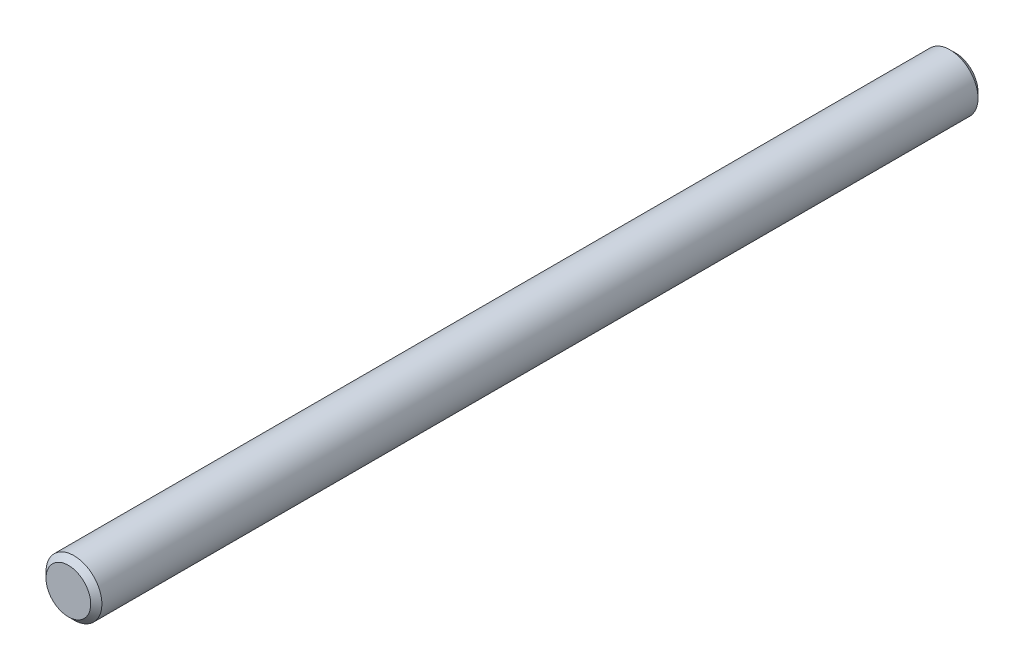
ISO-10303-21;
HEADER;
FILE_DESCRIPTION(('STEP AP214'),'2;1');
FILE_NAME('part.step','',(''),(''),'','','');
FILE_SCHEMA(('AUTOMOTIVE_DESIGN { 1 0 10303 214 1 1 1 1 }'));
ENDSEC;
DATA;
#1=APPLICATION_CONTEXT('core data for automotive mechanical design processes');
#2=APPLICATION_PROTOCOL_DEFINITION('international standard','automotive_design',2000,#1);
#3=PRODUCT_CONTEXT('',#1,'mechanical');
#4=PRODUCT('Part','Part','',(#3));
#5=PRODUCT_RELATED_PRODUCT_CATEGORY('part','',(#4));
#6=PRODUCT_DEFINITION_FORMATION('','',#4);
#7=PRODUCT_DEFINITION_CONTEXT('part definition',#1,'design');
#8=PRODUCT_DEFINITION('design','',#6,#7);
#9=PRODUCT_DEFINITION_SHAPE('','',#8);
#10=(LENGTH_UNIT() NAMED_UNIT(*) SI_UNIT(.MILLI.,.METRE.));
#11=(NAMED_UNIT(*) PLANE_ANGLE_UNIT() SI_UNIT($,.RADIAN.));
#12=(NAMED_UNIT(*) SI_UNIT($,.STERADIAN.) SOLID_ANGLE_UNIT());
#13=UNCERTAINTY_MEASURE_WITH_UNIT(LENGTH_MEASURE(1.E-05),#10,'distance_accuracy_value','');
#14=(GEOMETRIC_REPRESENTATION_CONTEXT(3) GLOBAL_UNCERTAINTY_ASSIGNED_CONTEXT((#13)) GLOBAL_UNIT_ASSIGNED_CONTEXT((#10,
#11,#12)) REPRESENTATION_CONTEXT('',''));
#15=CARTESIAN_POINT('',(0.,0.,0.));
#16=DIRECTION('',(0.,0.,1.));
#17=DIRECTION('',(1.,0.,0.));
#18=AXIS2_PLACEMENT_3D('',#15,#16,#17);
#19=CARTESIAN_POINT('',(0.,0.,75.6));
#20=DIRECTION('',(0.,0.,-1.));
#21=DIRECTION('',(-1.,0.,0.));
#22=AXIS2_PLACEMENT_3D('',#19,#20,#21);
#23=CYLINDRICAL_SURFACE('',#22,4.7625);
#24=CARTESIAN_POINT('',(0.,0.,-74.6475));
#25=DIRECTION('',(0.,0.,1.));
#26=DIRECTION('',(1.,0.,0.));
#27=AXIS2_PLACEMENT_3D('',#24,#25,#26);
#28=CIRCLE('',#27,4.7625);
#29=CARTESIAN_POINT('',(4.7625,0.,-74.6475));
#30=VERTEX_POINT('',#29);
#31=EDGE_CURVE('E50',#30,#30,#28,.T.);
#32=ORIENTED_EDGE('',*,*,#31,.T.);
#33=EDGE_LOOP('',(#32));
#34=FACE_BOUND('',#33,.T.);
#35=CARTESIAN_POINT('',(0.,0.,74.6475));
#36=DIRECTION('',(0.,0.,1.));
#37=DIRECTION('',(1.,0.,0.));
#38=AXIS2_PLACEMENT_3D('',#35,#36,#37);
#39=CIRCLE('',#38,4.7625);
#40=CARTESIAN_POINT('',(4.7625,0.,74.6475));
#41=VERTEX_POINT('',#40);
#42=EDGE_CURVE('E55',#41,#41,#39,.F.);
#43=ORIENTED_EDGE('',*,*,#42,.T.);
#44=EDGE_LOOP('',(#43));
#45=FACE_BOUND('',#44,.T.);
#46=ADVANCED_FACE('F37',(#34,#45),#23,.T.);
#47=CARTESIAN_POINT('',(0.,0.,75.6));
#48=DIRECTION('',(0.,0.,1.));
#49=DIRECTION('',(1.,0.,0.));
#50=AXIS2_PLACEMENT_3D('',#47,#48,#49);
#51=PLANE('',#50);
#52=CARTESIAN_POINT('',(0.,0.,75.6));
#53=DIRECTION('',(0.,0.,1.));
#54=DIRECTION('',(1.,0.,0.));
#55=AXIS2_PLACEMENT_3D('',#52,#53,#54);
#56=CIRCLE('',#55,3.81000000000002);
#57=CARTESIAN_POINT('',(3.81000000000002,0.,75.6));
#58=VERTEX_POINT('',#57);
#59=EDGE_CURVE('E10',#58,#58,#56,.T.);
#60=ORIENTED_EDGE('',*,*,#59,.T.);
#61=EDGE_LOOP('',(#60));
#62=FACE_BOUND('',#61,.T.);
#63=ADVANCED_FACE('F72',(#62),#51,.T.);
#64=CARTESIAN_POINT('',(0.,0.,-75.6));
#65=DIRECTION('',(0.,0.,1.));
#66=DIRECTION('',(1.,0.,0.));
#67=AXIS2_PLACEMENT_3D('',#64,#65,#66);
#68=PLANE('',#67);
#69=CARTESIAN_POINT('',(0.,0.,-75.6));
#70=DIRECTION('',(0.,0.,1.));
#71=DIRECTION('',(1.,0.,0.));
#72=AXIS2_PLACEMENT_3D('',#69,#70,#71);
#73=CIRCLE('',#72,3.81000000000001);
#74=CARTESIAN_POINT('',(3.81000000000001,0.,-75.6));
#75=VERTEX_POINT('',#74);
#76=EDGE_CURVE('E45',#75,#75,#73,.F.);
#77=ORIENTED_EDGE('',*,*,#76,.T.);
#78=EDGE_LOOP('',(#77));
#79=FACE_BOUND('',#78,.T.);
#80=ADVANCED_FACE('F69',(#79),#68,.F.);
#81=CARTESIAN_POINT('',(0.,0.,-74.6475));
#82=DIRECTION('',(0.,0.,1.));
#83=DIRECTION('',(1.,0.,0.));
#84=AXIS2_PLACEMENT_3D('',#81,#82,#83);
#85=CONICAL_SURFACE('',#84,4.7625,0.785398163397432);
#86=ORIENTED_EDGE('',*,*,#76,.F.);
#87=EDGE_LOOP('',(#86));
#88=FACE_BOUND('',#87,.T.);
#89=ORIENTED_EDGE('',*,*,#31,.F.);
#90=EDGE_LOOP('',(#89));
#91=FACE_BOUND('',#90,.T.);
#92=ADVANCED_FACE('F65',(#88,#91),#85,.T.);
#93=CARTESIAN_POINT('',(0.,0.,75.6));
#94=DIRECTION('',(0.,0.,-1.));
#95=DIRECTION('',(-1.,0.,0.));
#96=AXIS2_PLACEMENT_3D('',#93,#94,#95);
#97=CONICAL_SURFACE('',#96,3.81000000000002,0.785398163397447);
#98=ORIENTED_EDGE('',*,*,#42,.F.);
#99=EDGE_LOOP('',(#98));
#100=FACE_BOUND('',#99,.T.);
#101=ORIENTED_EDGE('',*,*,#59,.F.);
#102=EDGE_LOOP('',(#101));
#103=FACE_BOUND('',#102,.T.);
#104=ADVANCED_FACE('F39',(#100,#103),#97,.T.);
#105=CLOSED_SHELL('',(#46,#63,#80,#92,#104));
#106=MANIFOLD_SOLID_BREP('B2',#105);
#107=ADVANCED_BREP_SHAPE_REPRESENTATION('',(#18,#106),#14);
#108=SHAPE_DEFINITION_REPRESENTATION(#9,#107);
ENDSEC;
END-ISO-10303-21;
